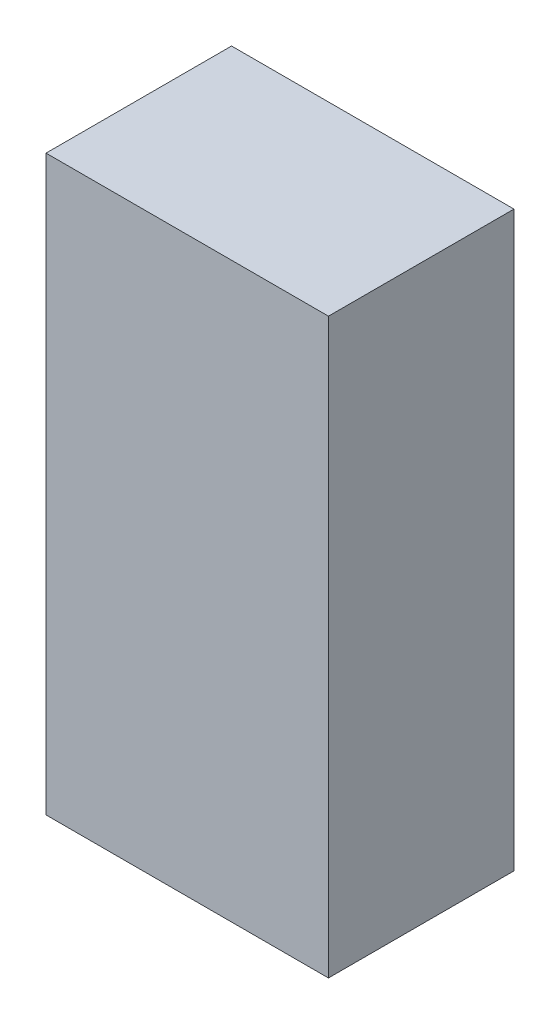
ISO-10303-21;
HEADER;
FILE_DESCRIPTION(('STEP AP214'),'2;1');
FILE_NAME('part.step','',(''),(''),'','','');
FILE_SCHEMA(('AUTOMOTIVE_DESIGN { 1 0 10303 214 1 1 1 1 }'));
ENDSEC;
DATA;
#1=APPLICATION_CONTEXT('core data for automotive mechanical design processes');
#2=APPLICATION_PROTOCOL_DEFINITION('international standard','automotive_design',2000,#1);
#3=PRODUCT_CONTEXT('',#1,'mechanical');
#4=PRODUCT('Part','Part','',(#3));
#5=PRODUCT_RELATED_PRODUCT_CATEGORY('part','',(#4));
#6=PRODUCT_DEFINITION_FORMATION('','',#4);
#7=PRODUCT_DEFINITION_CONTEXT('part definition',#1,'design');
#8=PRODUCT_DEFINITION('design','',#6,#7);
#9=PRODUCT_DEFINITION_SHAPE('','',#8);
#10=(LENGTH_UNIT() NAMED_UNIT(*) SI_UNIT(.MILLI.,.METRE.));
#11=(NAMED_UNIT(*) PLANE_ANGLE_UNIT() SI_UNIT($,.RADIAN.));
#12=(NAMED_UNIT(*) SI_UNIT($,.STERADIAN.) SOLID_ANGLE_UNIT());
#13=UNCERTAINTY_MEASURE_WITH_UNIT(LENGTH_MEASURE(1.E-05),#10,'distance_accuracy_value','');
#14=(GEOMETRIC_REPRESENTATION_CONTEXT(3) GLOBAL_UNCERTAINTY_ASSIGNED_CONTEXT((#13)) GLOBAL_UNIT_ASSIGNED_CONTEXT((#10,
#11,#12)) REPRESENTATION_CONTEXT('',''));
#15=CARTESIAN_POINT('',(0.,0.,0.));
#16=DIRECTION('',(0.,0.,1.));
#17=DIRECTION('',(1.,0.,0.));
#18=AXIS2_PLACEMENT_3D('',#15,#16,#17);
#19=CARTESIAN_POINT('',(12.954,52.578,8.509));
#20=DIRECTION('',(-1.,0.,0.));
#21=DIRECTION('',(0.,0.,1.));
#22=AXIS2_PLACEMENT_3D('',#19,#20,#21);
#23=PLANE('',#22);
#24=DIRECTION('',(0.,0.,-1.));
#25=VECTOR('',#24,1.);
#26=CARTESIAN_POINT('',(12.954,0.,8.509));
#27=LINE('',#26,#25);
#28=CARTESIAN_POINT('',(12.954,0.,8.509));
#29=VERTEX_POINT('',#28);
#30=CARTESIAN_POINT('',(12.954,0.,-8.509));
#31=VERTEX_POINT('',#30);
#32=EDGE_CURVE('E113',#29,#31,#27,.T.);
#33=ORIENTED_EDGE('',*,*,#32,.T.);
#34=DIRECTION('',(0.,-1.,0.));
#35=VECTOR('',#34,1.);
#36=CARTESIAN_POINT('',(12.954,52.578,-8.509));
#37=LINE('',#36,#35);
#38=CARTESIAN_POINT('',(12.954,52.578,-8.509));
#39=VERTEX_POINT('',#38);
#40=EDGE_CURVE('E11',#39,#31,#37,.T.);
#41=ORIENTED_EDGE('',*,*,#40,.F.);
#42=DIRECTION('',(0.,0.,-1.));
#43=VECTOR('',#42,1.);
#44=CARTESIAN_POINT('',(12.954,52.578,8.509));
#45=LINE('',#44,#43);
#46=CARTESIAN_POINT('',(12.954,52.578,8.509));
#47=VERTEX_POINT('',#46);
#48=EDGE_CURVE('E97',#47,#39,#45,.T.);
#49=ORIENTED_EDGE('',*,*,#48,.F.);
#50=DIRECTION('',(0.,-1.,0.));
#51=VECTOR('',#50,1.);
#52=CARTESIAN_POINT('',(12.954,52.578,8.509));
#53=LINE('',#52,#51);
#54=EDGE_CURVE('E109',#47,#29,#53,.T.);
#55=ORIENTED_EDGE('',*,*,#54,.T.);
#56=EDGE_LOOP('',(#33,#41,#49,#55));
#57=FACE_BOUND('',#56,.T.);
#58=ADVANCED_FACE('F45',(#57),#23,.F.);
#59=CARTESIAN_POINT('',(-12.954,52.578,-8.509));
#60=DIRECTION('',(0.,0.,1.));
#61=DIRECTION('',(1.,0.,0.));
#62=AXIS2_PLACEMENT_3D('',#59,#60,#61);
#63=PLANE('',#62);
#64=DIRECTION('',(-1.,0.,0.));
#65=VECTOR('',#64,1.);
#66=CARTESIAN_POINT('',(-12.954,0.,-8.509));
#67=LINE('',#66,#65);
#68=CARTESIAN_POINT('',(-12.954,0.,-8.509));
#69=VERTEX_POINT('',#68);
#70=EDGE_CURVE('E102',#31,#69,#67,.T.);
#71=ORIENTED_EDGE('',*,*,#70,.T.);
#72=DIRECTION('',(0.,-1.,0.));
#73=VECTOR('',#72,1.);
#74=CARTESIAN_POINT('',(-12.954,52.578,-8.509));
#75=LINE('',#74,#73);
#76=CARTESIAN_POINT('',(-12.954,52.578,-8.509));
#77=VERTEX_POINT('',#76);
#78=EDGE_CURVE('E54',#77,#69,#75,.T.);
#79=ORIENTED_EDGE('',*,*,#78,.F.);
#80=DIRECTION('',(-1.,0.,0.));
#81=VECTOR('',#80,1.);
#82=CARTESIAN_POINT('',(-12.954,52.578,-8.509));
#83=LINE('',#82,#81);
#84=EDGE_CURVE('E92',#39,#77,#83,.T.);
#85=ORIENTED_EDGE('',*,*,#84,.F.);
#86=ORIENTED_EDGE('',*,*,#40,.T.);
#87=EDGE_LOOP('',(#71,#79,#85,#86));
#88=FACE_BOUND('',#87,.T.);
#89=ADVANCED_FACE('F101',(#88),#63,.F.);
#90=CARTESIAN_POINT('',(-12.954,52.578,8.509));
#91=DIRECTION('',(1.,0.,0.));
#92=DIRECTION('',(0.,0.,-1.));
#93=AXIS2_PLACEMENT_3D('',#90,#91,#92);
#94=PLANE('',#93);
#95=DIRECTION('',(0.,0.,1.));
#96=VECTOR('',#95,1.);
#97=CARTESIAN_POINT('',(-12.954,0.,8.509));
#98=LINE('',#97,#96);
#99=CARTESIAN_POINT('',(-12.954,0.,8.509));
#100=VERTEX_POINT('',#99);
#101=EDGE_CURVE('E79',#69,#100,#98,.T.);
#102=ORIENTED_EDGE('',*,*,#101,.T.);
#103=DIRECTION('',(0.,-1.,0.));
#104=VECTOR('',#103,1.);
#105=CARTESIAN_POINT('',(-12.954,52.578,8.509));
#106=LINE('',#105,#104);
#107=CARTESIAN_POINT('',(-12.954,52.578,8.509));
#108=VERTEX_POINT('',#107);
#109=EDGE_CURVE('E104',#108,#100,#106,.T.);
#110=ORIENTED_EDGE('',*,*,#109,.F.);
#111=DIRECTION('',(0.,0.,1.));
#112=VECTOR('',#111,1.);
#113=CARTESIAN_POINT('',(-12.954,52.578,8.509));
#114=LINE('',#113,#112);
#115=EDGE_CURVE('E95',#77,#108,#114,.T.);
#116=ORIENTED_EDGE('',*,*,#115,.F.);
#117=ORIENTED_EDGE('',*,*,#78,.T.);
#118=EDGE_LOOP('',(#102,#110,#116,#117));
#119=FACE_BOUND('',#118,.T.);
#120=ADVANCED_FACE('F105',(#119),#94,.F.);
#121=CARTESIAN_POINT('',(-12.954,52.578,8.509));
#122=DIRECTION('',(0.,0.,-1.));
#123=DIRECTION('',(-1.,0.,0.));
#124=AXIS2_PLACEMENT_3D('',#121,#122,#123);
#125=PLANE('',#124);
#126=DIRECTION('',(1.,0.,0.));
#127=VECTOR('',#126,1.);
#128=CARTESIAN_POINT('',(-12.954,0.,8.509));
#129=LINE('',#128,#127);
#130=EDGE_CURVE('E85',#100,#29,#129,.T.);
#131=ORIENTED_EDGE('',*,*,#130,.T.);
#132=ORIENTED_EDGE('',*,*,#54,.F.);
#133=DIRECTION('',(1.,0.,0.));
#134=VECTOR('',#133,1.);
#135=CARTESIAN_POINT('',(-12.954,52.578,8.509));
#136=LINE('',#135,#134);
#137=EDGE_CURVE('E62',#108,#47,#136,.T.);
#138=ORIENTED_EDGE('',*,*,#137,.F.);
#139=ORIENTED_EDGE('',*,*,#109,.T.);
#140=EDGE_LOOP('',(#131,#132,#138,#139));
#141=FACE_BOUND('',#140,.T.);
#142=ADVANCED_FACE('F126',(#141),#125,.F.);
#143=CARTESIAN_POINT('',(0.,52.578,0.));
#144=DIRECTION('',(0.,-1.,0.));
#145=DIRECTION('',(0.,0.,-1.));
#146=AXIS2_PLACEMENT_3D('',#143,#144,#145);
#147=PLANE('',#146);
#148=ORIENTED_EDGE('',*,*,#48,.T.);
#149=ORIENTED_EDGE('',*,*,#84,.T.);
#150=ORIENTED_EDGE('',*,*,#115,.T.);
#151=ORIENTED_EDGE('',*,*,#137,.T.);
#152=EDGE_LOOP('',(#148,#149,#150,#151));
#153=FACE_BOUND('',#152,.T.);
#154=ADVANCED_FACE('F93',(#153),#147,.F.);
#155=CARTESIAN_POINT('',(0.,0.,0.));
#156=DIRECTION('',(0.,-1.,0.));
#157=DIRECTION('',(0.,0.,-1.));
#158=AXIS2_PLACEMENT_3D('',#155,#156,#157);
#159=PLANE('',#158);
#160=ORIENTED_EDGE('',*,*,#32,.F.);
#161=ORIENTED_EDGE('',*,*,#130,.F.);
#162=ORIENTED_EDGE('',*,*,#101,.F.);
#163=ORIENTED_EDGE('',*,*,#70,.F.);
#164=EDGE_LOOP('',(#160,#161,#162,#163));
#165=FACE_BOUND('',#164,.T.);
#166=ADVANCED_FACE('F129',(#165),#159,.T.);
#167=CLOSED_SHELL('',(#58,#89,#120,#142,#154,#166));
#168=MANIFOLD_SOLID_BREP('B2',#167);
#169=ADVANCED_BREP_SHAPE_REPRESENTATION('',(#18,#168),#14);
#170=SHAPE_DEFINITION_REPRESENTATION(#9,#169);
ENDSEC;
END-ISO-10303-21;
